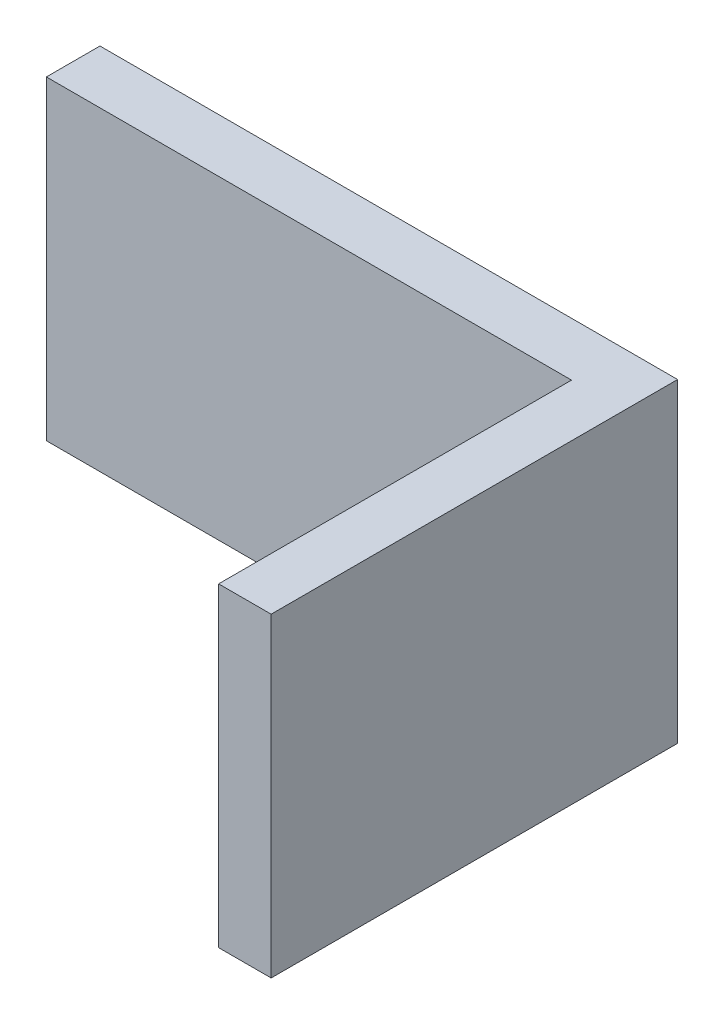
ISO-10303-21;
HEADER;
FILE_DESCRIPTION(('STEP AP214'),'2;1');
FILE_NAME('part.step','',(''),(''),'','','');
FILE_SCHEMA(('AUTOMOTIVE_DESIGN { 1 0 10303 214 1 1 1 1 }'));
ENDSEC;
DATA;
#1=APPLICATION_CONTEXT('core data for automotive mechanical design processes');
#2=APPLICATION_PROTOCOL_DEFINITION('international standard','automotive_design',2000,#1);
#3=PRODUCT_CONTEXT('',#1,'mechanical');
#4=PRODUCT('Part','Part','',(#3));
#5=PRODUCT_RELATED_PRODUCT_CATEGORY('part','',(#4));
#6=PRODUCT_DEFINITION_FORMATION('','',#4);
#7=PRODUCT_DEFINITION_CONTEXT('part definition',#1,'design');
#8=PRODUCT_DEFINITION('design','',#6,#7);
#9=PRODUCT_DEFINITION_SHAPE('','',#8);
#10=(LENGTH_UNIT() NAMED_UNIT(*) SI_UNIT(.MILLI.,.METRE.));
#11=(NAMED_UNIT(*) PLANE_ANGLE_UNIT() SI_UNIT($,.RADIAN.));
#12=(NAMED_UNIT(*) SI_UNIT($,.STERADIAN.) SOLID_ANGLE_UNIT());
#13=UNCERTAINTY_MEASURE_WITH_UNIT(LENGTH_MEASURE(1.E-05),#10,'distance_accuracy_value','');
#14=(GEOMETRIC_REPRESENTATION_CONTEXT(3) GLOBAL_UNCERTAINTY_ASSIGNED_CONTEXT((#13)) GLOBAL_UNIT_ASSIGNED_CONTEXT((#10,
#11,#12)) REPRESENTATION_CONTEXT('',''));
#15=CARTESIAN_POINT('',(0.,0.,0.));
#16=DIRECTION('',(0.,0.,1.));
#17=DIRECTION('',(1.,0.,0.));
#18=AXIS2_PLACEMENT_3D('',#15,#16,#17);
#19=CARTESIAN_POINT('',(4.55,1.4,0.));
#20=DIRECTION('',(0.,1.,0.));
#21=DIRECTION('',(0.,0.,1.));
#22=AXIS2_PLACEMENT_3D('',#19,#20,#21);
#23=PLANE('',#22);
#24=DIRECTION('',(1.,0.,0.));
#25=VECTOR('',#24,1.);
#26=CARTESIAN_POINT('',(4.,1.4,0.));
#27=LINE('',#26,#25);
#28=CARTESIAN_POINT('',(4.,1.4,0.));
#29=VERTEX_POINT('',#28);
#30=CARTESIAN_POINT('',(4.55,1.4,0.));
#31=VERTEX_POINT('',#30);
#32=EDGE_CURVE('E11',#29,#31,#27,.T.);
#33=ORIENTED_EDGE('',*,*,#32,.F.);
#34=DIRECTION('',(0.,0.,-1.));
#35=VECTOR('',#34,1.);
#36=CARTESIAN_POINT('',(4.,1.4,0.051));
#37=LINE('',#36,#35);
#38=CARTESIAN_POINT('',(4.,1.4,0.051));
#39=VERTEX_POINT('',#38);
#40=EDGE_CURVE('E24',#39,#29,#37,.T.);
#41=ORIENTED_EDGE('',*,*,#40,.F.);
#42=DIRECTION('',(-1.,0.,0.));
#43=VECTOR('',#42,1.);
#44=CARTESIAN_POINT('',(4.5,1.4,0.051));
#45=LINE('',#44,#43);
#46=CARTESIAN_POINT('',(4.5,1.4,0.051));
#47=VERTEX_POINT('',#46);
#48=EDGE_CURVE('E87',#47,#39,#45,.T.);
#49=ORIENTED_EDGE('',*,*,#48,.F.);
#50=DIRECTION('',(0.,0.,-1.));
#51=VECTOR('',#50,1.);
#52=CARTESIAN_POINT('',(4.5,1.4,0.387));
#53=LINE('',#52,#51);
#54=CARTESIAN_POINT('',(4.5,1.4,0.387));
#55=VERTEX_POINT('',#54);
#56=EDGE_CURVE('E114',#55,#47,#53,.T.);
#57=ORIENTED_EDGE('',*,*,#56,.F.);
#58=DIRECTION('',(-1.,0.,0.));
#59=VECTOR('',#58,1.);
#60=CARTESIAN_POINT('',(4.55,1.4,0.387));
#61=LINE('',#60,#59);
#62=CARTESIAN_POINT('',(4.55,1.4,0.387));
#63=VERTEX_POINT('',#62);
#64=EDGE_CURVE('E111',#63,#55,#61,.T.);
#65=ORIENTED_EDGE('',*,*,#64,.F.);
#66=DIRECTION('',(0.,0.,1.));
#67=VECTOR('',#66,1.);
#68=CARTESIAN_POINT('',(4.55,1.4,0.));
#69=LINE('',#68,#67);
#70=EDGE_CURVE('E108',#31,#63,#69,.T.);
#71=ORIENTED_EDGE('',*,*,#70,.F.);
#72=EDGE_LOOP('',(#33,#41,#49,#57,#65,#71));
#73=FACE_BOUND('',#72,.T.);
#74=ADVANCED_FACE('F17',(#73),#23,.T.);
#75=CARTESIAN_POINT('',(4.,1.1,0.));
#76=DIRECTION('',(0.,-1.,0.));
#77=DIRECTION('',(0.,0.,1.));
#78=AXIS2_PLACEMENT_3D('',#75,#76,#77);
#79=PLANE('',#78);
#80=DIRECTION('',(-1.,0.,0.));
#81=VECTOR('',#80,1.);
#82=CARTESIAN_POINT('',(4.55,1.1,0.));
#83=LINE('',#82,#81);
#84=CARTESIAN_POINT('',(4.55,1.1,0.));
#85=VERTEX_POINT('',#84);
#86=CARTESIAN_POINT('',(4.,1.1,0.));
#87=VERTEX_POINT('',#86);
#88=EDGE_CURVE('E106',#85,#87,#83,.T.);
#89=ORIENTED_EDGE('',*,*,#88,.F.);
#90=DIRECTION('',(0.,0.,-1.));
#91=VECTOR('',#90,1.);
#92=CARTESIAN_POINT('',(4.55,1.1,0.387));
#93=LINE('',#92,#91);
#94=CARTESIAN_POINT('',(4.55,1.1,0.387));
#95=VERTEX_POINT('',#94);
#96=EDGE_CURVE('E103',#95,#85,#93,.T.);
#97=ORIENTED_EDGE('',*,*,#96,.F.);
#98=DIRECTION('',(1.,0.,0.));
#99=VECTOR('',#98,1.);
#100=CARTESIAN_POINT('',(4.5,1.1,0.387));
#101=LINE('',#100,#99);
#102=CARTESIAN_POINT('',(4.5,1.1,0.387));
#103=VERTEX_POINT('',#102);
#104=EDGE_CURVE('E100',#103,#95,#101,.T.);
#105=ORIENTED_EDGE('',*,*,#104,.F.);
#106=DIRECTION('',(0.,0.,1.));
#107=VECTOR('',#106,1.);
#108=CARTESIAN_POINT('',(4.5,1.1,0.051));
#109=LINE('',#108,#107);
#110=CARTESIAN_POINT('',(4.5,1.1,0.051));
#111=VERTEX_POINT('',#110);
#112=EDGE_CURVE('E72',#111,#103,#109,.T.);
#113=ORIENTED_EDGE('',*,*,#112,.F.);
#114=DIRECTION('',(1.,0.,0.));
#115=VECTOR('',#114,1.);
#116=CARTESIAN_POINT('',(4.,1.1,0.051));
#117=LINE('',#116,#115);
#118=CARTESIAN_POINT('',(4.,1.1,0.051));
#119=VERTEX_POINT('',#118);
#120=EDGE_CURVE('E66',#119,#111,#117,.T.);
#121=ORIENTED_EDGE('',*,*,#120,.F.);
#122=DIRECTION('',(0.,0.,1.));
#123=VECTOR('',#122,1.);
#124=CARTESIAN_POINT('',(4.,1.1,0.));
#125=LINE('',#124,#123);
#126=EDGE_CURVE('E69',#87,#119,#125,.T.);
#127=ORIENTED_EDGE('',*,*,#126,.F.);
#128=EDGE_LOOP('',(#89,#97,#105,#113,#121,#127));
#129=FACE_BOUND('',#128,.T.);
#130=ADVANCED_FACE('F68',(#129),#79,.T.);
#131=CARTESIAN_POINT('',(4.55,1.4,0.387));
#132=DIRECTION('',(0.,0.,1.));
#133=DIRECTION('',(0.,1.,0.));
#134=AXIS2_PLACEMENT_3D('',#131,#132,#133);
#135=PLANE('',#134);
#136=ORIENTED_EDGE('',*,*,#64,.T.);
#137=DIRECTION('',(0.,1.,0.));
#138=VECTOR('',#137,1.);
#139=CARTESIAN_POINT('',(4.5,1.1,0.387));
#140=LINE('',#139,#138);
#141=EDGE_CURVE('E83',#103,#55,#140,.T.);
#142=ORIENTED_EDGE('',*,*,#141,.F.);
#143=ORIENTED_EDGE('',*,*,#104,.T.);
#144=DIRECTION('',(0.,-1.,0.));
#145=VECTOR('',#144,1.);
#146=CARTESIAN_POINT('',(4.55,1.4,0.387));
#147=LINE('',#146,#145);
#148=EDGE_CURVE('E88',#63,#95,#147,.T.);
#149=ORIENTED_EDGE('',*,*,#148,.F.);
#150=EDGE_LOOP('',(#136,#142,#143,#149));
#151=FACE_BOUND('',#150,.T.);
#152=ADVANCED_FACE('F125',(#151),#135,.T.);
#153=CARTESIAN_POINT('',(4.5,1.4,0.051));
#154=DIRECTION('',(0.,0.,1.));
#155=DIRECTION('',(0.,1.,0.));
#156=AXIS2_PLACEMENT_3D('',#153,#154,#155);
#157=PLANE('',#156);
#158=ORIENTED_EDGE('',*,*,#48,.T.);
#159=DIRECTION('',(0.,1.,0.));
#160=VECTOR('',#159,1.);
#161=CARTESIAN_POINT('',(4.,1.1,0.051));
#162=LINE('',#161,#160);
#163=EDGE_CURVE('E81',#119,#39,#162,.T.);
#164=ORIENTED_EDGE('',*,*,#163,.F.);
#165=ORIENTED_EDGE('',*,*,#120,.T.);
#166=DIRECTION('',(0.,-1.,0.));
#167=VECTOR('',#166,1.);
#168=CARTESIAN_POINT('',(4.5,1.4,0.051));
#169=LINE('',#168,#167);
#170=EDGE_CURVE('E89',#47,#111,#169,.T.);
#171=ORIENTED_EDGE('',*,*,#170,.F.);
#172=EDGE_LOOP('',(#158,#164,#165,#171));
#173=FACE_BOUND('',#172,.T.);
#174=ADVANCED_FACE('F86',(#173),#157,.T.);
#175=CARTESIAN_POINT('',(4.55,1.1,0.));
#176=DIRECTION('',(1.,0.,0.));
#177=DIRECTION('',(0.,0.,1.));
#178=AXIS2_PLACEMENT_3D('',#175,#176,#177);
#179=PLANE('',#178);
#180=DIRECTION('',(0.,-1.,0.));
#181=VECTOR('',#180,1.);
#182=CARTESIAN_POINT('',(4.55,1.4,0.));
#183=LINE('',#182,#181);
#184=EDGE_CURVE('E93',#31,#85,#183,.T.);
#185=ORIENTED_EDGE('',*,*,#184,.F.);
#186=ORIENTED_EDGE('',*,*,#70,.T.);
#187=ORIENTED_EDGE('',*,*,#148,.T.);
#188=ORIENTED_EDGE('',*,*,#96,.T.);
#189=EDGE_LOOP('',(#185,#186,#187,#188));
#190=FACE_BOUND('',#189,.T.);
#191=ADVANCED_FACE('F121',(#190),#179,.T.);
#192=CARTESIAN_POINT('',(4.,1.4,0.));
#193=DIRECTION('',(-1.,0.,0.));
#194=DIRECTION('',(0.,0.,1.));
#195=AXIS2_PLACEMENT_3D('',#192,#193,#194);
#196=PLANE('',#195);
#197=DIRECTION('',(0.,1.,0.));
#198=VECTOR('',#197,1.);
#199=CARTESIAN_POINT('',(4.,1.1,0.));
#200=LINE('',#199,#198);
#201=EDGE_CURVE('E82',#87,#29,#200,.T.);
#202=ORIENTED_EDGE('',*,*,#201,.F.);
#203=ORIENTED_EDGE('',*,*,#126,.T.);
#204=ORIENTED_EDGE('',*,*,#163,.T.);
#205=ORIENTED_EDGE('',*,*,#40,.T.);
#206=EDGE_LOOP('',(#202,#203,#204,#205));
#207=FACE_BOUND('',#206,.T.);
#208=ADVANCED_FACE('F80',(#207),#196,.T.);
#209=CARTESIAN_POINT('',(4.5,1.4,0.051));
#210=DIRECTION('',(-1.,0.,0.));
#211=DIRECTION('',(0.,0.,1.));
#212=AXIS2_PLACEMENT_3D('',#209,#210,#211);
#213=PLANE('',#212);
#214=ORIENTED_EDGE('',*,*,#170,.T.);
#215=ORIENTED_EDGE('',*,*,#112,.T.);
#216=ORIENTED_EDGE('',*,*,#141,.T.);
#217=ORIENTED_EDGE('',*,*,#56,.T.);
#218=EDGE_LOOP('',(#214,#215,#216,#217));
#219=FACE_BOUND('',#218,.T.);
#220=ADVANCED_FACE('F127',(#219),#213,.T.);
#221=CARTESIAN_POINT('',(4.55,1.1,0.));
#222=DIRECTION('',(0.,0.,-1.));
#223=DIRECTION('',(0.,1.,0.));
#224=AXIS2_PLACEMENT_3D('',#221,#222,#223);
#225=PLANE('',#224);
#226=ORIENTED_EDGE('',*,*,#88,.T.);
#227=ORIENTED_EDGE('',*,*,#201,.T.);
#228=ORIENTED_EDGE('',*,*,#32,.T.);
#229=ORIENTED_EDGE('',*,*,#184,.T.);
#230=EDGE_LOOP('',(#226,#227,#228,#229));
#231=FACE_BOUND('',#230,.T.);
#232=ADVANCED_FACE('F117',(#231),#225,.T.);
#233=CLOSED_SHELL('',(#74,#130,#152,#174,#191,#208,#220,#232));
#234=MANIFOLD_SOLID_BREP('B1',#233);
#235=ADVANCED_BREP_SHAPE_REPRESENTATION('',(#18,#234),#14);
#236=SHAPE_DEFINITION_REPRESENTATION(#9,#235);
ENDSEC;
END-ISO-10303-21;
